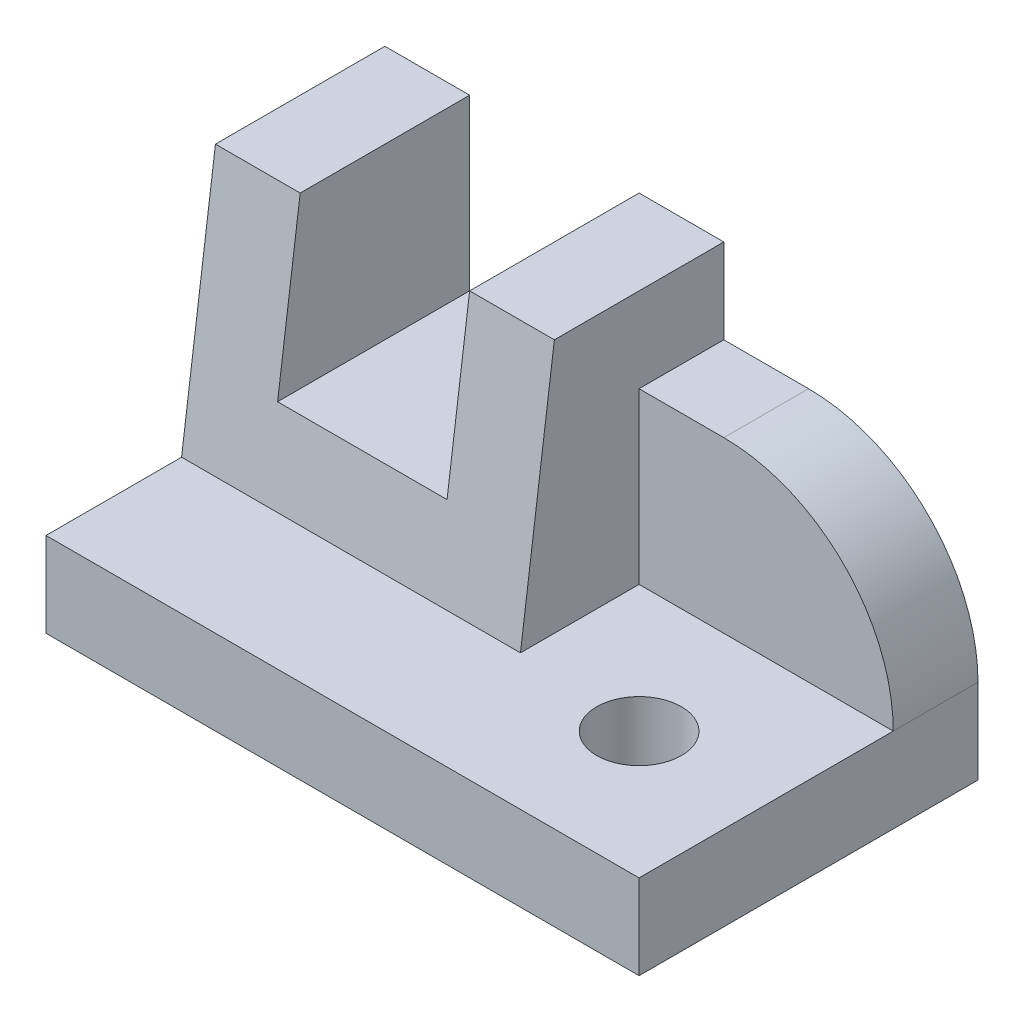
ISO-10303-21;
HEADER;
FILE_DESCRIPTION(('STEP AP214'),'2;1');
FILE_NAME('part.step','',(''),(''),'','','');
FILE_SCHEMA(('AUTOMOTIVE_DESIGN { 1 0 10303 214 1 1 1 1 }'));
ENDSEC;
DATA;
#1=APPLICATION_CONTEXT('core data for automotive mechanical design processes');
#2=APPLICATION_PROTOCOL_DEFINITION('international standard','automotive_design',2000,#1);
#3=PRODUCT_CONTEXT('',#1,'mechanical');
#4=PRODUCT('Part','Part','',(#3));
#5=PRODUCT_RELATED_PRODUCT_CATEGORY('part','',(#4));
#6=PRODUCT_DEFINITION_FORMATION('','',#4);
#7=PRODUCT_DEFINITION_CONTEXT('part definition',#1,'design');
#8=PRODUCT_DEFINITION('design','',#6,#7);
#9=PRODUCT_DEFINITION_SHAPE('','',#8);
#10=(LENGTH_UNIT() NAMED_UNIT(*) SI_UNIT(.MILLI.,.METRE.));
#11=(NAMED_UNIT(*) PLANE_ANGLE_UNIT() SI_UNIT($,.RADIAN.));
#12=(NAMED_UNIT(*) SI_UNIT($,.STERADIAN.) SOLID_ANGLE_UNIT());
#13=UNCERTAINTY_MEASURE_WITH_UNIT(LENGTH_MEASURE(1.E-05),#10,'distance_accuracy_value','');
#14=(GEOMETRIC_REPRESENTATION_CONTEXT(3) GLOBAL_UNCERTAINTY_ASSIGNED_CONTEXT((#13)) GLOBAL_UNIT_ASSIGNED_CONTEXT((#10,
#11,#12)) REPRESENTATION_CONTEXT('',''));
#15=CARTESIAN_POINT('',(0.,0.,0.));
#16=DIRECTION('',(0.,0.,1.));
#17=DIRECTION('',(1.,0.,0.));
#18=AXIS2_PLACEMENT_3D('',#15,#16,#17);
#19=CARTESIAN_POINT('',(40.,40.,-40.));
#20=DIRECTION('',(0.,-1.,0.));
#21=DIRECTION('',(0.,0.,-1.));
#22=AXIS2_PLACEMENT_3D('',#19,#20,#21);
#23=PLANE('',#22);
#24=DIRECTION('',(-1.,0.,0.));
#25=VECTOR('',#24,1.);
#26=CARTESIAN_POINT('',(40.,40.,-20.));
#27=LINE('',#26,#25);
#28=CARTESIAN_POINT('',(9.99999999999998,40.,-20.));
#29=VERTEX_POINT('',#28);
#30=CARTESIAN_POINT('',(0.,40.,-20.));
#31=VERTEX_POINT('',#30);
#32=EDGE_CURVE('E235',#29,#31,#27,.T.);
#33=ORIENTED_EDGE('',*,*,#32,.F.);
#34=DIRECTION('',(0.,0.,-1.));
#35=VECTOR('',#34,1.);
#36=CARTESIAN_POINT('',(9.99999999999998,40.,0.));
#37=LINE('',#36,#35);
#38=CARTESIAN_POINT('',(9.99999999999999,40.,-40.));
#39=VERTEX_POINT('',#38);
#40=EDGE_CURVE('E160',#29,#39,#37,.T.);
#41=ORIENTED_EDGE('',*,*,#40,.T.);
#42=DIRECTION('',(1.,0.,0.));
#43=VECTOR('',#42,1.);
#44=CARTESIAN_POINT('',(40.,40.,-40.));
#45=LINE('',#44,#43);
#46=CARTESIAN_POINT('',(0.,40.,-40.));
#47=VERTEX_POINT('',#46);
#48=EDGE_CURVE('E219',#47,#39,#45,.T.);
#49=ORIENTED_EDGE('',*,*,#48,.F.);
#50=DIRECTION('',(0.,0.,1.));
#51=VECTOR('',#50,1.);
#52=CARTESIAN_POINT('',(0.,40.,-40.));
#53=LINE('',#52,#51);
#54=EDGE_CURVE('E221',#47,#31,#53,.T.);
#55=ORIENTED_EDGE('',*,*,#54,.T.);
#56=EDGE_LOOP('',(#33,#41,#49,#55));
#57=FACE_BOUND('',#56,.T.);
#58=ADVANCED_FACE('F35',(#57),#23,.F.);
#59=CARTESIAN_POINT('',(40.,10.,-16.));
#60=DIRECTION('',(0.,0.132163720091018,0.991227900682635));
#61=DIRECTION('',(0.,-0.991227900682635,0.132163720091018));
#62=AXIS2_PLACEMENT_3D('',#59,#60,#61);
#63=PLANE('',#62);
#64=DIRECTION('',(0.,-0.991227900682635,0.132163720091018));
#65=VECTOR('',#64,1.);
#66=CARTESIAN_POINT('',(9.99999999999998,10.,-16.));
#67=LINE('',#66,#65);
#68=CARTESIAN_POINT('',(9.99999999999998,20.,-17.3333333333333));
#69=VERTEX_POINT('',#68);
#70=EDGE_CURVE('E168',#29,#69,#67,.T.);
#71=ORIENTED_EDGE('',*,*,#70,.F.);
#72=ORIENTED_EDGE('',*,*,#32,.T.);
#73=DIRECTION('',(0.,0.991227900682635,-0.132163720091018));
#74=VECTOR('',#73,1.);
#75=CARTESIAN_POINT('',(0.,10.,-16.));
#76=LINE('',#75,#74);
#77=CARTESIAN_POINT('',(0.,10.,-16.));
#78=VERTEX_POINT('',#77);
#79=EDGE_CURVE('E224',#78,#31,#76,.T.);
#80=ORIENTED_EDGE('',*,*,#79,.F.);
#81=DIRECTION('',(-1.,0.,0.));
#82=VECTOR('',#81,1.);
#83=CARTESIAN_POINT('',(40.,10.,-16.));
#84=LINE('',#83,#82);
#85=CARTESIAN_POINT('',(40.,10.,-16.));
#86=VERTEX_POINT('',#85);
#87=EDGE_CURVE('E228',#86,#78,#84,.T.);
#88=ORIENTED_EDGE('',*,*,#87,.F.);
#89=DIRECTION('',(0.,0.991227900682635,-0.132163720091018));
#90=VECTOR('',#89,1.);
#91=CARTESIAN_POINT('',(40.,10.,-16.));
#92=LINE('',#91,#90);
#93=CARTESIAN_POINT('',(40.,40.,-20.));
#94=VERTEX_POINT('',#93);
#95=EDGE_CURVE('E225',#86,#94,#92,.T.);
#96=ORIENTED_EDGE('',*,*,#95,.T.);
#97=CARTESIAN_POINT('',(30.,40.,-20.));
#98=VERTEX_POINT('',#97);
#99=EDGE_CURVE('E231',#94,#98,#27,.T.);
#100=ORIENTED_EDGE('',*,*,#99,.T.);
#101=DIRECTION('',(0.,0.991227900682635,-0.132163720091018));
#102=VECTOR('',#101,1.);
#103=CARTESIAN_POINT('',(30.,10.,-16.));
#104=LINE('',#103,#102);
#105=CARTESIAN_POINT('',(30.,20.,-17.3333333333333));
#106=VERTEX_POINT('',#105);
#107=EDGE_CURVE('E163',#106,#98,#104,.T.);
#108=ORIENTED_EDGE('',*,*,#107,.F.);
#109=DIRECTION('',(1.,0.,0.));
#110=VECTOR('',#109,1.);
#111=CARTESIAN_POINT('',(40.,20.,-17.3333333333333));
#112=LINE('',#111,#110);
#113=EDGE_CURVE('E140',#69,#106,#112,.T.);
#114=ORIENTED_EDGE('',*,*,#113,.F.);
#115=EDGE_LOOP('',(#71,#72,#80,#88,#96,#100,#108,#114));
#116=FACE_BOUND('',#115,.T.);
#117=ADVANCED_FACE('F270',(#116),#63,.T.);
#118=CARTESIAN_POINT('',(0.,0.,0.));
#119=DIRECTION('',(1.,0.,0.));
#120=DIRECTION('',(0.,0.,-1.));
#121=AXIS2_PLACEMENT_3D('',#118,#119,#120);
#122=PLANE('',#121);
#123=DIRECTION('',(0.,1.,0.));
#124=VECTOR('',#123,1.);
#125=CARTESIAN_POINT('',(0.,40.,-40.));
#126=LINE('',#125,#124);
#127=CARTESIAN_POINT('',(0.,0.,-40.));
#128=VERTEX_POINT('',#127);
#129=EDGE_CURVE('E216',#128,#47,#126,.T.);
#130=ORIENTED_EDGE('',*,*,#129,.F.);
#131=DIRECTION('',(0.,0.,-1.));
#132=VECTOR('',#131,1.);
#133=CARTESIAN_POINT('',(0.,0.,-40.));
#134=LINE('',#133,#132);
#135=CARTESIAN_POINT('',(0.,0.,0.));
#136=VERTEX_POINT('',#135);
#137=EDGE_CURVE('E174',#136,#128,#134,.T.);
#138=ORIENTED_EDGE('',*,*,#137,.F.);
#139=DIRECTION('',(0.,1.,0.));
#140=VECTOR('',#139,1.);
#141=CARTESIAN_POINT('',(0.,0.,0.));
#142=LINE('',#141,#140);
#143=CARTESIAN_POINT('',(0.,10.,0.));
#144=VERTEX_POINT('',#143);
#145=EDGE_CURVE('E192',#136,#144,#142,.T.);
#146=ORIENTED_EDGE('',*,*,#145,.T.);
#147=DIRECTION('',(0.,0.,-1.));
#148=VECTOR('',#147,1.);
#149=CARTESIAN_POINT('',(0.,10.,-40.));
#150=LINE('',#149,#148);
#151=EDGE_CURVE('E186',#144,#78,#150,.T.);
#152=ORIENTED_EDGE('',*,*,#151,.T.);
#153=ORIENTED_EDGE('',*,*,#79,.T.);
#154=ORIENTED_EDGE('',*,*,#54,.F.);
#155=EDGE_LOOP('',(#130,#138,#146,#152,#153,#154));
#156=FACE_BOUND('',#155,.T.);
#157=ADVANCED_FACE('F273',(#156),#122,.F.);
#158=CARTESIAN_POINT('',(30.,40.,-40.));
#159=VERTEX_POINT('',#158);
#160=CARTESIAN_POINT('',(40.,40.,-40.));
#161=VERTEX_POINT('',#160);
#162=EDGE_CURVE('E218',#159,#161,#45,.T.);
#163=ORIENTED_EDGE('',*,*,#162,.F.);
#164=DIRECTION('',(0.,0.,-1.));
#165=VECTOR('',#164,1.);
#166=CARTESIAN_POINT('',(30.,40.,0.));
#167=LINE('',#166,#165);
#168=EDGE_CURVE('E144',#98,#159,#167,.T.);
#169=ORIENTED_EDGE('',*,*,#168,.F.);
#170=ORIENTED_EDGE('',*,*,#99,.F.);
#171=DIRECTION('',(0.,0.,1.));
#172=VECTOR('',#171,1.);
#173=CARTESIAN_POINT('',(40.,40.,-40.));
#174=LINE('',#173,#172);
#175=EDGE_CURVE('E195',#161,#94,#174,.T.);
#176=ORIENTED_EDGE('',*,*,#175,.F.);
#177=EDGE_LOOP('',(#163,#169,#170,#176));
#178=FACE_BOUND('',#177,.T.);
#179=ADVANCED_FACE('F267',(#178),#23,.F.);
#180=CARTESIAN_POINT('',(0.,0.,-40.));
#181=DIRECTION('',(0.,0.,1.));
#182=DIRECTION('',(0.,-1.,0.));
#183=AXIS2_PLACEMENT_3D('',#180,#181,#182);
#184=PLANE('',#183);
#185=DIRECTION('',(1.,0.,0.));
#186=VECTOR('',#185,1.);
#187=CARTESIAN_POINT('',(40.,30.,-40.));
#188=LINE('',#187,#186);
#189=CARTESIAN_POINT('',(40.,30.,-40.));
#190=VERTEX_POINT('',#189);
#191=CARTESIAN_POINT('',(50.,30.,-40.));
#192=VERTEX_POINT('',#191);
#193=EDGE_CURVE('E209',#190,#192,#188,.T.);
#194=ORIENTED_EDGE('',*,*,#193,.T.);
#195=CARTESIAN_POINT('',(50.,9.99999999999999,-40.));
#196=DIRECTION('',(0.,0.,1.));
#197=DIRECTION('',(0.,-1.,0.));
#198=AXIS2_PLACEMENT_3D('',#195,#196,#197);
#199=CIRCLE('',#198,20.);
#200=CARTESIAN_POINT('',(70.,10.,-40.));
#201=VERTEX_POINT('',#200);
#202=EDGE_CURVE('E50',#192,#201,#199,.F.);
#203=ORIENTED_EDGE('',*,*,#202,.T.);
#204=DIRECTION('',(0.,1.,0.));
#205=VECTOR('',#204,1.);
#206=CARTESIAN_POINT('',(70.,40.,-40.));
#207=LINE('',#206,#205);
#208=CARTESIAN_POINT('',(70.,0.,-40.));
#209=VERTEX_POINT('',#208);
#210=EDGE_CURVE('E211',#209,#201,#207,.T.);
#211=ORIENTED_EDGE('',*,*,#210,.F.);
#212=DIRECTION('',(1.,0.,0.));
#213=VECTOR('',#212,1.);
#214=CARTESIAN_POINT('',(70.,0.,-40.));
#215=LINE('',#214,#213);
#216=EDGE_CURVE('E178',#128,#209,#215,.T.);
#217=ORIENTED_EDGE('',*,*,#216,.F.);
#218=ORIENTED_EDGE('',*,*,#129,.T.);
#219=ORIENTED_EDGE('',*,*,#48,.T.);
#220=DIRECTION('',(0.,1.,0.));
#221=VECTOR('',#220,1.);
#222=CARTESIAN_POINT('',(9.99999999999999,20.,-40.));
#223=LINE('',#222,#221);
#224=CARTESIAN_POINT('',(9.99999999999999,20.,-40.));
#225=VERTEX_POINT('',#224);
#226=EDGE_CURVE('E155',#225,#39,#223,.T.);
#227=ORIENTED_EDGE('',*,*,#226,.F.);
#228=DIRECTION('',(-1.,0.,0.));
#229=VECTOR('',#228,1.);
#230=CARTESIAN_POINT('',(30.,20.,-40.));
#231=LINE('',#230,#229);
#232=CARTESIAN_POINT('',(30.,20.,-40.));
#233=VERTEX_POINT('',#232);
#234=EDGE_CURVE('E137',#233,#225,#231,.T.);
#235=ORIENTED_EDGE('',*,*,#234,.F.);
#236=DIRECTION('',(0.,-1.,0.));
#237=VECTOR('',#236,1.);
#238=CARTESIAN_POINT('',(30.,40.,-40.));
#239=LINE('',#238,#237);
#240=EDGE_CURVE('E147',#159,#233,#239,.T.);
#241=ORIENTED_EDGE('',*,*,#240,.F.);
#242=ORIENTED_EDGE('',*,*,#162,.T.);
#243=DIRECTION('',(0.,1.,0.));
#244=VECTOR('',#243,1.);
#245=CARTESIAN_POINT('',(40.,30.,-40.));
#246=LINE('',#245,#244);
#247=EDGE_CURVE('E205',#190,#161,#246,.T.);
#248=ORIENTED_EDGE('',*,*,#247,.F.);
#249=EDGE_LOOP('',(#194,#203,#211,#217,#218,#219,#227,#235,#241,#242,#248));
#250=FACE_BOUND('',#249,.T.);
#251=ADVANCED_FACE('F153',(#250),#184,.F.);
#252=CARTESIAN_POINT('',(70.,0.,0.));
#253=DIRECTION('',(-1.,0.,0.));
#254=DIRECTION('',(0.,0.,1.));
#255=AXIS2_PLACEMENT_3D('',#252,#253,#254);
#256=PLANE('',#255);
#257=ORIENTED_EDGE('',*,*,#210,.T.);
#258=DIRECTION('',(0.,0.,-1.));
#259=VECTOR('',#258,1.);
#260=CARTESIAN_POINT('',(70.,9.99999999999999,0.));
#261=LINE('',#260,#259);
#262=CARTESIAN_POINT('',(70.,10.,-30.));
#263=VERTEX_POINT('',#262);
#264=EDGE_CURVE('E43',#201,#263,#261,.F.);
#265=ORIENTED_EDGE('',*,*,#264,.T.);
#266=DIRECTION('',(0.,0.,1.));
#267=VECTOR('',#266,1.);
#268=CARTESIAN_POINT('',(70.,10.,0.));
#269=LINE('',#268,#267);
#270=CARTESIAN_POINT('',(70.,10.,0.));
#271=VERTEX_POINT('',#270);
#272=EDGE_CURVE('E175',#263,#271,#269,.T.);
#273=ORIENTED_EDGE('',*,*,#272,.T.);
#274=DIRECTION('',(0.,1.,0.));
#275=VECTOR('',#274,1.);
#276=CARTESIAN_POINT('',(70.,0.,0.));
#277=LINE('',#276,#275);
#278=CARTESIAN_POINT('',(70.,0.,0.));
#279=VERTEX_POINT('',#278);
#280=EDGE_CURVE('E183',#279,#271,#277,.T.);
#281=ORIENTED_EDGE('',*,*,#280,.F.);
#282=DIRECTION('',(0.,0.,1.));
#283=VECTOR('',#282,1.);
#284=CARTESIAN_POINT('',(70.,0.,0.));
#285=LINE('',#284,#283);
#286=EDGE_CURVE('E181',#209,#279,#285,.T.);
#287=ORIENTED_EDGE('',*,*,#286,.F.);
#288=EDGE_LOOP('',(#257,#265,#273,#281,#287));
#289=FACE_BOUND('',#288,.T.);
#290=ADVANCED_FACE('F245',(#289),#256,.F.);
#291=CARTESIAN_POINT('',(40.,30.,-30.));
#292=DIRECTION('',(0.,-1.,0.));
#293=DIRECTION('',(0.,0.,-1.));
#294=AXIS2_PLACEMENT_3D('',#291,#292,#293);
#295=PLANE('',#294);
#296=DIRECTION('',(1.,0.,0.));
#297=VECTOR('',#296,1.);
#298=CARTESIAN_POINT('',(40.,30.,-30.));
#299=LINE('',#298,#297);
#300=CARTESIAN_POINT('',(40.,30.,-30.));
#301=VERTEX_POINT('',#300);
#302=CARTESIAN_POINT('',(50.,30.,-30.));
#303=VERTEX_POINT('',#302);
#304=EDGE_CURVE('E212',#301,#303,#299,.T.);
#305=ORIENTED_EDGE('',*,*,#304,.T.);
#306=DIRECTION('',(0.,0.,-1.));
#307=VECTOR('',#306,1.);
#308=CARTESIAN_POINT('',(50.,30.,-30.));
#309=LINE('',#308,#307);
#310=EDGE_CURVE('E234',#303,#192,#309,.T.);
#311=ORIENTED_EDGE('',*,*,#310,.T.);
#312=ORIENTED_EDGE('',*,*,#193,.F.);
#313=DIRECTION('',(0.,0.,-1.));
#314=VECTOR('',#313,1.);
#315=CARTESIAN_POINT('',(40.,30.,-30.));
#316=LINE('',#315,#314);
#317=EDGE_CURVE('E202',#301,#190,#316,.T.);
#318=ORIENTED_EDGE('',*,*,#317,.F.);
#319=EDGE_LOOP('',(#305,#311,#312,#318));
#320=FACE_BOUND('',#319,.T.);
#321=ADVANCED_FACE('F259',(#320),#295,.F.);
#322=CARTESIAN_POINT('',(40.,10.,-30.));
#323=DIRECTION('',(0.,0.,-1.));
#324=DIRECTION('',(-1.,0.,0.));
#325=AXIS2_PLACEMENT_3D('',#322,#323,#324);
#326=PLANE('',#325);
#327=DIRECTION('',(1.,0.,0.));
#328=VECTOR('',#327,1.);
#329=CARTESIAN_POINT('',(40.,10.,-30.));
#330=LINE('',#329,#328);
#331=CARTESIAN_POINT('',(40.,10.,-30.));
#332=VERTEX_POINT('',#331);
#333=EDGE_CURVE('E208',#332,#263,#330,.T.);
#334=ORIENTED_EDGE('',*,*,#333,.T.);
#335=CARTESIAN_POINT('',(50.,9.99999999999999,-30.));
#336=DIRECTION('',(0.,0.,-1.));
#337=DIRECTION('',(-1.,0.,0.));
#338=AXIS2_PLACEMENT_3D('',#335,#336,#337);
#339=CIRCLE('',#338,20.);
#340=EDGE_CURVE('E11',#263,#303,#339,.F.);
#341=ORIENTED_EDGE('',*,*,#340,.T.);
#342=ORIENTED_EDGE('',*,*,#304,.F.);
#343=DIRECTION('',(0.,1.,0.));
#344=VECTOR('',#343,1.);
#345=CARTESIAN_POINT('',(40.,10.,-30.));
#346=LINE('',#345,#344);
#347=EDGE_CURVE('E199',#332,#301,#346,.T.);
#348=ORIENTED_EDGE('',*,*,#347,.F.);
#349=EDGE_LOOP('',(#334,#341,#342,#348));
#350=FACE_BOUND('',#349,.T.);
#351=ADVANCED_FACE('F252',(#350),#326,.F.);
#352=CARTESIAN_POINT('',(40.,0.,0.));
#353=DIRECTION('',(-1.,0.,0.));
#354=DIRECTION('',(0.,0.,1.));
#355=AXIS2_PLACEMENT_3D('',#352,#353,#354);
#356=PLANE('',#355);
#357=ORIENTED_EDGE('',*,*,#95,.F.);
#358=DIRECTION('',(0.,0.,-1.));
#359=VECTOR('',#358,1.);
#360=CARTESIAN_POINT('',(40.,10.,0.));
#361=LINE('',#360,#359);
#362=EDGE_CURVE('E197',#86,#332,#361,.T.);
#363=ORIENTED_EDGE('',*,*,#362,.T.);
#364=ORIENTED_EDGE('',*,*,#347,.T.);
#365=ORIENTED_EDGE('',*,*,#317,.T.);
#366=ORIENTED_EDGE('',*,*,#247,.T.);
#367=ORIENTED_EDGE('',*,*,#175,.T.);
#368=EDGE_LOOP('',(#357,#363,#364,#365,#366,#367));
#369=FACE_BOUND('',#368,.T.);
#370=ADVANCED_FACE('F264',(#369),#356,.F.);
#371=CARTESIAN_POINT('',(0.,10.,0.));
#372=DIRECTION('',(0.,1.,0.));
#373=DIRECTION('',(0.,0.,1.));
#374=AXIS2_PLACEMENT_3D('',#371,#372,#373);
#375=PLANE('',#374);
#376=CARTESIAN_POINT('',(55.,10.,-15.));
#377=DIRECTION('',(0.,1.,0.));
#378=DIRECTION('',(0.,0.,1.));
#379=AXIS2_PLACEMENT_3D('',#376,#377,#378);
#380=CIRCLE('',#379,4.99999999999998);
#381=CARTESIAN_POINT('',(55.,10.,-10.));
#382=VERTEX_POINT('',#381);
#383=EDGE_CURVE('E151',#382,#382,#380,.T.);
#384=ORIENTED_EDGE('',*,*,#383,.F.);
#385=EDGE_LOOP('',(#384));
#386=FACE_BOUND('',#385,.T.);
#387=ORIENTED_EDGE('',*,*,#333,.F.);
#388=ORIENTED_EDGE('',*,*,#362,.F.);
#389=ORIENTED_EDGE('',*,*,#87,.T.);
#390=ORIENTED_EDGE('',*,*,#151,.F.);
#391=DIRECTION('',(-1.,0.,0.));
#392=VECTOR('',#391,1.);
#393=CARTESIAN_POINT('',(0.,10.,0.));
#394=LINE('',#393,#392);
#395=EDGE_CURVE('E170',#271,#144,#394,.T.);
#396=ORIENTED_EDGE('',*,*,#395,.F.);
#397=ORIENTED_EDGE('',*,*,#272,.F.);
#398=EDGE_LOOP('',(#387,#388,#389,#390,#396,#397));
#399=FACE_BOUND('',#398,.T.);
#400=ADVANCED_FACE('F256',(#386,#399),#375,.T.);
#401=CARTESIAN_POINT('',(0.,0.,0.));
#402=DIRECTION('',(0.,0.,-1.));
#403=DIRECTION('',(-1.,0.,0.));
#404=AXIS2_PLACEMENT_3D('',#401,#402,#403);
#405=PLANE('',#404);
#406=ORIENTED_EDGE('',*,*,#395,.T.);
#407=ORIENTED_EDGE('',*,*,#145,.F.);
#408=DIRECTION('',(-1.,0.,0.));
#409=VECTOR('',#408,1.);
#410=CARTESIAN_POINT('',(0.,0.,0.));
#411=LINE('',#410,#409);
#412=EDGE_CURVE('E171',#279,#136,#411,.T.);
#413=ORIENTED_EDGE('',*,*,#412,.F.);
#414=ORIENTED_EDGE('',*,*,#280,.T.);
#415=EDGE_LOOP('',(#406,#407,#413,#414));
#416=FACE_BOUND('',#415,.T.);
#417=ADVANCED_FACE('F278',(#416),#405,.F.);
#418=CARTESIAN_POINT('',(0.,0.,0.));
#419=DIRECTION('',(0.,1.,0.));
#420=DIRECTION('',(0.,0.,1.));
#421=AXIS2_PLACEMENT_3D('',#418,#419,#420);
#422=PLANE('',#421);
#423=CARTESIAN_POINT('',(55.,0.,-15.));
#424=DIRECTION('',(0.,-1.,0.));
#425=DIRECTION('',(0.,0.,-1.));
#426=AXIS2_PLACEMENT_3D('',#423,#424,#425);
#427=CIRCLE('',#426,4.99999999999998);
#428=CARTESIAN_POINT('',(55.,0.,-20.));
#429=VERTEX_POINT('',#428);
#430=EDGE_CURVE('E240',#429,#429,#427,.T.);
#431=ORIENTED_EDGE('',*,*,#430,.F.);
#432=EDGE_LOOP('',(#431));
#433=FACE_BOUND('',#432,.T.);
#434=ORIENTED_EDGE('',*,*,#412,.T.);
#435=ORIENTED_EDGE('',*,*,#137,.T.);
#436=ORIENTED_EDGE('',*,*,#216,.T.);
#437=ORIENTED_EDGE('',*,*,#286,.T.);
#438=EDGE_LOOP('',(#434,#435,#436,#437));
#439=FACE_BOUND('',#438,.T.);
#440=ADVANCED_FACE('F280',(#433,#439),#422,.F.);
#441=CARTESIAN_POINT('',(9.99999999999998,20.,0.));
#442=DIRECTION('',(-1.,0.,0.));
#443=DIRECTION('',(0.,0.,1.));
#444=AXIS2_PLACEMENT_3D('',#441,#442,#443);
#445=PLANE('',#444);
#446=ORIENTED_EDGE('',*,*,#70,.T.);
#447=DIRECTION('',(0.,0.,-1.));
#448=VECTOR('',#447,1.);
#449=CARTESIAN_POINT('',(9.99999999999998,20.,0.));
#450=LINE('',#449,#448);
#451=EDGE_CURVE('E143',#69,#225,#450,.T.);
#452=ORIENTED_EDGE('',*,*,#451,.T.);
#453=ORIENTED_EDGE('',*,*,#226,.T.);
#454=ORIENTED_EDGE('',*,*,#40,.F.);
#455=EDGE_LOOP('',(#446,#452,#453,#454));
#456=FACE_BOUND('',#455,.T.);
#457=ADVANCED_FACE('F286',(#456),#445,.F.);
#458=CARTESIAN_POINT('',(30.,20.,0.));
#459=DIRECTION('',(0.,-1.,0.));
#460=DIRECTION('',(0.,0.,-1.));
#461=AXIS2_PLACEMENT_3D('',#458,#459,#460);
#462=PLANE('',#461);
#463=ORIENTED_EDGE('',*,*,#113,.T.);
#464=DIRECTION('',(0.,0.,-1.));
#465=VECTOR('',#464,1.);
#466=CARTESIAN_POINT('',(30.,20.,0.));
#467=LINE('',#466,#465);
#468=EDGE_CURVE('E132',#106,#233,#467,.T.);
#469=ORIENTED_EDGE('',*,*,#468,.T.);
#470=ORIENTED_EDGE('',*,*,#234,.T.);
#471=ORIENTED_EDGE('',*,*,#451,.F.);
#472=EDGE_LOOP('',(#463,#469,#470,#471));
#473=FACE_BOUND('',#472,.T.);
#474=ADVANCED_FACE('F134',(#473),#462,.F.);
#475=CARTESIAN_POINT('',(30.,40.,0.));
#476=DIRECTION('',(1.,0.,0.));
#477=DIRECTION('',(0.,0.,-1.));
#478=AXIS2_PLACEMENT_3D('',#475,#476,#477);
#479=PLANE('',#478);
#480=ORIENTED_EDGE('',*,*,#107,.T.);
#481=ORIENTED_EDGE('',*,*,#168,.T.);
#482=ORIENTED_EDGE('',*,*,#240,.T.);
#483=ORIENTED_EDGE('',*,*,#468,.F.);
#484=EDGE_LOOP('',(#480,#481,#482,#483));
#485=FACE_BOUND('',#484,.T.);
#486=ADVANCED_FACE('F148',(#485),#479,.F.);
#487=CARTESIAN_POINT('',(55.,0.,-15.));
#488=DIRECTION('',(0.,-1.,0.));
#489=DIRECTION('',(0.,0.,-1.));
#490=AXIS2_PLACEMENT_3D('',#487,#488,#489);
#491=CYLINDRICAL_SURFACE('',#490,4.99999999999998);
#492=ORIENTED_EDGE('',*,*,#383,.T.);
#493=EDGE_LOOP('',(#492));
#494=FACE_BOUND('',#493,.T.);
#495=ORIENTED_EDGE('',*,*,#430,.T.);
#496=EDGE_LOOP('',(#495));
#497=FACE_BOUND('',#496,.T.);
#498=ADVANCED_FACE('F346',(#494,#497),#491,.F.);
#499=CARTESIAN_POINT('',(50.,9.99999999999999,-30.));
#500=DIRECTION('',(0.,0.,-1.));
#501=DIRECTION('',(-1.,0.,0.));
#502=AXIS2_PLACEMENT_3D('',#499,#500,#501);
#503=CYLINDRICAL_SURFACE('',#502,20.);
#504=ORIENTED_EDGE('',*,*,#340,.F.);
#505=ORIENTED_EDGE('',*,*,#264,.F.);
#506=ORIENTED_EDGE('',*,*,#202,.F.);
#507=ORIENTED_EDGE('',*,*,#310,.F.);
#508=EDGE_LOOP('',(#504,#505,#506,#507));
#509=FACE_BOUND('',#508,.T.);
#510=ADVANCED_FACE('F37',(#509),#503,.T.);
#511=CLOSED_SHELL('',(#58,#117,#157,#179,#251,#290,#321,#351,#370,#400,#417,#440,#457,#474,#486,
#498,#510));
#512=MANIFOLD_SOLID_BREP('B2',#511);
#513=ADVANCED_BREP_SHAPE_REPRESENTATION('',(#18,#512),#14);
#514=SHAPE_DEFINITION_REPRESENTATION(#9,#513);
ENDSEC;
END-ISO-10303-21;
